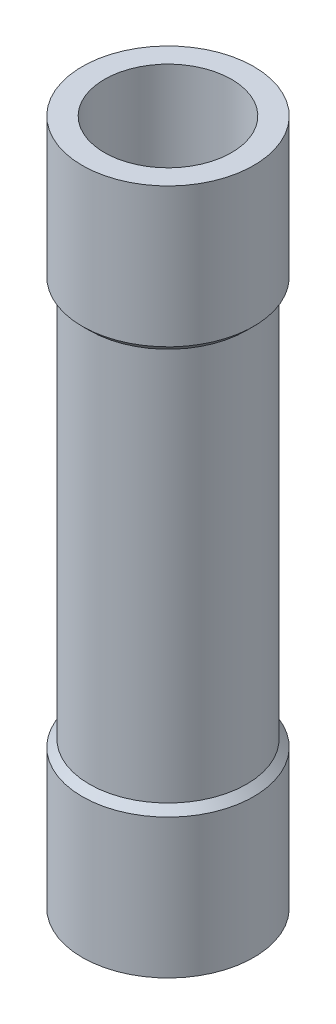
ISO-10303-21;
HEADER;
FILE_DESCRIPTION(('STEP AP214'),'2;1');
FILE_NAME('part.step','',(''),(''),'','','');
FILE_SCHEMA(('AUTOMOTIVE_DESIGN { 1 0 10303 214 1 1 1 1 }'));
ENDSEC;
DATA;
#1=APPLICATION_CONTEXT('core data for automotive mechanical design processes');
#2=APPLICATION_PROTOCOL_DEFINITION('international standard','automotive_design',2000,#1);
#3=PRODUCT_CONTEXT('',#1,'mechanical');
#4=PRODUCT('Part','Part','',(#3));
#5=PRODUCT_RELATED_PRODUCT_CATEGORY('part','',(#4));
#6=PRODUCT_DEFINITION_FORMATION('','',#4);
#7=PRODUCT_DEFINITION_CONTEXT('part definition',#1,'design');
#8=PRODUCT_DEFINITION('design','',#6,#7);
#9=PRODUCT_DEFINITION_SHAPE('','',#8);
#10=(LENGTH_UNIT() NAMED_UNIT(*) SI_UNIT(.MILLI.,.METRE.));
#11=(NAMED_UNIT(*) PLANE_ANGLE_UNIT() SI_UNIT($,.RADIAN.));
#12=(NAMED_UNIT(*) SI_UNIT($,.STERADIAN.) SOLID_ANGLE_UNIT());
#13=UNCERTAINTY_MEASURE_WITH_UNIT(LENGTH_MEASURE(1.E-05),#10,'distance_accuracy_value','');
#14=(GEOMETRIC_REPRESENTATION_CONTEXT(3) GLOBAL_UNCERTAINTY_ASSIGNED_CONTEXT((#13)) GLOBAL_UNIT_ASSIGNED_CONTEXT((#10,
#11,#12)) REPRESENTATION_CONTEXT('',''));
#15=CARTESIAN_POINT('',(0.,0.,0.));
#16=DIRECTION('',(0.,0.,1.));
#17=DIRECTION('',(1.,0.,0.));
#18=AXIS2_PLACEMENT_3D('',#15,#16,#17);
#19=CARTESIAN_POINT('',(3.048,12.192,0.));
#20=DIRECTION('',(0.,1.,0.));
#21=DIRECTION('',(0.,0.,1.));
#22=AXIS2_PLACEMENT_3D('',#19,#20,#21);
#23=PLANE('',#22);
#24=CARTESIAN_POINT('',(0.,12.192,0.));
#25=DIRECTION('',(0.,-1.,0.));
#26=DIRECTION('',(0.,0.,-1.));
#27=AXIS2_PLACEMENT_3D('',#24,#25,#26);
#28=CIRCLE('',#27,2.259);
#29=CARTESIAN_POINT('',(0.,12.192,-2.259));
#30=VERTEX_POINT('',#29);
#31=EDGE_CURVE('E11',#30,#30,#28,.T.);
#32=ORIENTED_EDGE('',*,*,#31,.T.);
#33=EDGE_LOOP('',(#32));
#34=FACE_BOUND('',#33,.T.);
#35=CARTESIAN_POINT('',(0.,12.192,0.));
#36=DIRECTION('',(0.,-1.,0.));
#37=DIRECTION('',(0.,0.,-1.));
#38=AXIS2_PLACEMENT_3D('',#35,#36,#37);
#39=CIRCLE('',#38,3.048);
#40=CARTESIAN_POINT('',(0.,12.192,-3.048));
#41=VERTEX_POINT('',#40);
#42=EDGE_CURVE('E71',#41,#41,#39,.T.);
#43=ORIENTED_EDGE('',*,*,#42,.F.);
#44=EDGE_LOOP('',(#43));
#45=FACE_BOUND('',#44,.T.);
#46=ADVANCED_FACE('F43',(#34,#45),#23,.T.);
#47=CARTESIAN_POINT('',(0.,0.,0.));
#48=DIRECTION('',(0.,-1.,0.));
#49=DIRECTION('',(0.,0.,-1.));
#50=AXIS2_PLACEMENT_3D('',#47,#48,#49);
#51=CYLINDRICAL_SURFACE('',#50,2.259);
#52=CARTESIAN_POINT('',(0.,-12.192,0.));
#53=DIRECTION('',(0.,-1.,0.));
#54=DIRECTION('',(0.,0.,-1.));
#55=AXIS2_PLACEMENT_3D('',#52,#53,#54);
#56=CIRCLE('',#55,2.259);
#57=CARTESIAN_POINT('',(0.,-12.192,-2.259));
#58=VERTEX_POINT('',#57);
#59=EDGE_CURVE('E49',#58,#58,#56,.T.);
#60=ORIENTED_EDGE('',*,*,#59,.T.);
#61=EDGE_LOOP('',(#60));
#62=FACE_BOUND('',#61,.T.);
#63=ORIENTED_EDGE('',*,*,#31,.F.);
#64=EDGE_LOOP('',(#63));
#65=FACE_BOUND('',#64,.T.);
#66=ADVANCED_FACE('F79',(#62,#65),#51,.F.);
#67=CARTESIAN_POINT('',(2.259,-12.192,0.));
#68=DIRECTION('',(0.,-1.,0.));
#69=DIRECTION('',(0.,0.,-1.));
#70=AXIS2_PLACEMENT_3D('',#67,#68,#69);
#71=PLANE('',#70);
#72=CARTESIAN_POINT('',(0.,-12.192,0.));
#73=DIRECTION('',(0.,-1.,0.));
#74=DIRECTION('',(0.,0.,-1.));
#75=AXIS2_PLACEMENT_3D('',#72,#73,#74);
#76=CIRCLE('',#75,3.048);
#77=CARTESIAN_POINT('',(0.,-12.192,-3.048));
#78=VERTEX_POINT('',#77);
#79=EDGE_CURVE('E53',#78,#78,#76,.T.);
#80=ORIENTED_EDGE('',*,*,#79,.T.);
#81=EDGE_LOOP('',(#80));
#82=FACE_BOUND('',#81,.T.);
#83=ORIENTED_EDGE('',*,*,#59,.F.);
#84=EDGE_LOOP('',(#83));
#85=FACE_BOUND('',#84,.T.);
#86=ADVANCED_FACE('F83',(#82,#85),#71,.T.);
#87=CARTESIAN_POINT('',(0.,0.,0.));
#88=DIRECTION('',(0.,-1.,0.));
#89=DIRECTION('',(0.,0.,-1.));
#90=AXIS2_PLACEMENT_3D('',#87,#88,#89);
#91=CYLINDRICAL_SURFACE('',#90,3.048);
#92=CARTESIAN_POINT('',(0.,-7.239,0.));
#93=DIRECTION('',(0.,-1.,0.));
#94=DIRECTION('',(0.,0.,-1.));
#95=AXIS2_PLACEMENT_3D('',#92,#93,#94);
#96=CIRCLE('',#95,3.048);
#97=CARTESIAN_POINT('',(0.,-7.239,-3.048));
#98=VERTEX_POINT('',#97);
#99=EDGE_CURVE('E57',#98,#98,#96,.T.);
#100=ORIENTED_EDGE('',*,*,#99,.T.);
#101=EDGE_LOOP('',(#100));
#102=FACE_BOUND('',#101,.T.);
#103=ORIENTED_EDGE('',*,*,#79,.F.);
#104=EDGE_LOOP('',(#103));
#105=FACE_BOUND('',#104,.T.);
#106=ADVANCED_FACE('F87',(#102,#105),#91,.T.);
#107=CARTESIAN_POINT('',(0.,-7.239,0.));
#108=DIRECTION('',(0.,-1.,0.));
#109=DIRECTION('',(0.,0.,-1.));
#110=AXIS2_PLACEMENT_3D('',#107,#108,#109);
#111=CONICAL_SURFACE('',#110,3.048,0.785398163397442);
#112=CARTESIAN_POINT('',(0.,-6.98499999999999,0.));
#113=DIRECTION('',(0.,-1.,0.));
#114=DIRECTION('',(0.,0.,-1.));
#115=AXIS2_PLACEMENT_3D('',#112,#113,#114);
#116=CIRCLE('',#115,2.794);
#117=CARTESIAN_POINT('',(0.,-6.98499999999999,-2.794));
#118=VERTEX_POINT('',#117);
#119=EDGE_CURVE('E62',#118,#118,#116,.T.);
#120=ORIENTED_EDGE('',*,*,#119,.T.);
#121=EDGE_LOOP('',(#120));
#122=FACE_BOUND('',#121,.T.);
#123=ORIENTED_EDGE('',*,*,#99,.F.);
#124=EDGE_LOOP('',(#123));
#125=FACE_BOUND('',#124,.T.);
#126=ADVANCED_FACE('F94',(#122,#125),#111,.T.);
#127=CARTESIAN_POINT('',(0.,0.,0.));
#128=DIRECTION('',(0.,-1.,0.));
#129=DIRECTION('',(0.,0.,-1.));
#130=AXIS2_PLACEMENT_3D('',#127,#128,#129);
#131=CYLINDRICAL_SURFACE('',#130,2.794);
#132=CARTESIAN_POINT('',(0.,6.98499999999999,0.));
#133=DIRECTION('',(0.,-1.,0.));
#134=DIRECTION('',(0.,0.,-1.));
#135=AXIS2_PLACEMENT_3D('',#132,#133,#134);
#136=CIRCLE('',#135,2.794);
#137=CARTESIAN_POINT('',(0.,6.98499999999999,-2.794));
#138=VERTEX_POINT('',#137);
#139=EDGE_CURVE('E65',#138,#138,#136,.T.);
#140=ORIENTED_EDGE('',*,*,#139,.T.);
#141=EDGE_LOOP('',(#140));
#142=FACE_BOUND('',#141,.T.);
#143=ORIENTED_EDGE('',*,*,#119,.F.);
#144=EDGE_LOOP('',(#143));
#145=FACE_BOUND('',#144,.T.);
#146=ADVANCED_FACE('F98',(#142,#145),#131,.T.);
#147=CARTESIAN_POINT('',(0.,6.98499999999999,0.));
#148=DIRECTION('',(0.,1.,0.));
#149=DIRECTION('',(0.,0.,1.));
#150=AXIS2_PLACEMENT_3D('',#147,#148,#149);
#151=CONICAL_SURFACE('',#150,2.794,0.785398163397442);
#152=CARTESIAN_POINT('',(0.,7.239,0.));
#153=DIRECTION('',(0.,-1.,0.));
#154=DIRECTION('',(0.,0.,-1.));
#155=AXIS2_PLACEMENT_3D('',#152,#153,#154);
#156=CIRCLE('',#155,3.048);
#157=CARTESIAN_POINT('',(0.,7.239,-3.048));
#158=VERTEX_POINT('',#157);
#159=EDGE_CURVE('E68',#158,#158,#156,.T.);
#160=ORIENTED_EDGE('',*,*,#159,.T.);
#161=EDGE_LOOP('',(#160));
#162=FACE_BOUND('',#161,.T.);
#163=ORIENTED_EDGE('',*,*,#139,.F.);
#164=EDGE_LOOP('',(#163));
#165=FACE_BOUND('',#164,.T.);
#166=ADVANCED_FACE('F102',(#162,#165),#151,.T.);
#167=CARTESIAN_POINT('',(0.,0.,0.));
#168=DIRECTION('',(0.,-1.,0.));
#169=DIRECTION('',(0.,0.,-1.));
#170=AXIS2_PLACEMENT_3D('',#167,#168,#169);
#171=CYLINDRICAL_SURFACE('',#170,3.048);
#172=ORIENTED_EDGE('',*,*,#42,.T.);
#173=EDGE_LOOP('',(#172));
#174=FACE_BOUND('',#173,.T.);
#175=ORIENTED_EDGE('',*,*,#159,.F.);
#176=EDGE_LOOP('',(#175));
#177=FACE_BOUND('',#176,.T.);
#178=ADVANCED_FACE('F75',(#174,#177),#171,.T.);
#179=CLOSED_SHELL('',(#46,#66,#86,#106,#126,#146,#166,#178));
#180=MANIFOLD_SOLID_BREP('B2',#179);
#181=CARTESIAN_POINT('',(0.,0.,0.));
#182=DIRECTION('',(0.,-1.,0.));
#183=DIRECTION('',(0.,0.,-1.));
#184=AXIS2_PLACEMENT_3D('',#181,#182,#183);
#185=CYLINDRICAL_SURFACE('',#184,2.159);
#186=CARTESIAN_POINT('',(0.,7.239,0.));
#187=DIRECTION('',(0.,-1.,0.));
#188=DIRECTION('',(0.,0.,-1.));
#189=AXIS2_PLACEMENT_3D('',#186,#187,#188);
#190=CIRCLE('',#189,2.159);
#191=CARTESIAN_POINT('',(0.,7.239,-2.159));
#192=VERTEX_POINT('',#191);
#193=EDGE_CURVE('E179',#192,#192,#190,.T.);
#194=ORIENTED_EDGE('',*,*,#193,.T.);
#195=EDGE_LOOP('',(#194));
#196=FACE_BOUND('',#195,.T.);
#197=CARTESIAN_POINT('',(0.,-7.239,0.));
#198=DIRECTION('',(0.,-1.,0.));
#199=DIRECTION('',(0.,0.,-1.));
#200=AXIS2_PLACEMENT_3D('',#197,#198,#199);
#201=CIRCLE('',#200,2.159);
#202=CARTESIAN_POINT('',(0.,-7.239,-2.159));
#203=VERTEX_POINT('',#202);
#204=EDGE_CURVE('E42',#203,#203,#201,.T.);
#205=ORIENTED_EDGE('',*,*,#204,.F.);
#206=EDGE_LOOP('',(#205));
#207=FACE_BOUND('',#206,.T.);
#208=ADVANCED_FACE('F165',(#196,#207),#185,.T.);
#209=CARTESIAN_POINT('',(1.016,-7.239,0.));
#210=DIRECTION('',(0.,-1.,0.));
#211=DIRECTION('',(0.,0.,-1.));
#212=AXIS2_PLACEMENT_3D('',#209,#210,#211);
#213=PLANE('',#212);
#214=ORIENTED_EDGE('',*,*,#204,.T.);
#215=EDGE_LOOP('',(#214));
#216=FACE_BOUND('',#215,.T.);
#217=CARTESIAN_POINT('',(0.,-7.239,0.));
#218=DIRECTION('',(0.,-1.,0.));
#219=DIRECTION('',(0.,0.,-1.));
#220=AXIS2_PLACEMENT_3D('',#217,#218,#219);
#221=CIRCLE('',#220,1.016);
#222=CARTESIAN_POINT('',(0.,-7.239,-1.016));
#223=VERTEX_POINT('',#222);
#224=EDGE_CURVE('E171',#223,#223,#221,.T.);
#225=ORIENTED_EDGE('',*,*,#224,.F.);
#226=EDGE_LOOP('',(#225));
#227=FACE_BOUND('',#226,.T.);
#228=ADVANCED_FACE('F195',(#216,#227),#213,.T.);
#229=CARTESIAN_POINT('',(0.,0.,0.));
#230=DIRECTION('',(0.,-1.,0.));
#231=DIRECTION('',(0.,0.,-1.));
#232=AXIS2_PLACEMENT_3D('',#229,#230,#231);
#233=CYLINDRICAL_SURFACE('',#232,1.016);
#234=ORIENTED_EDGE('',*,*,#224,.T.);
#235=EDGE_LOOP('',(#234));
#236=FACE_BOUND('',#235,.T.);
#237=CARTESIAN_POINT('',(0.,7.239,0.));
#238=DIRECTION('',(0.,-1.,0.));
#239=DIRECTION('',(0.,0.,-1.));
#240=AXIS2_PLACEMENT_3D('',#237,#238,#239);
#241=CIRCLE('',#240,1.016);
#242=CARTESIAN_POINT('',(0.,7.239,-1.016));
#243=VERTEX_POINT('',#242);
#244=EDGE_CURVE('E175',#243,#243,#241,.T.);
#245=ORIENTED_EDGE('',*,*,#244,.F.);
#246=EDGE_LOOP('',(#245));
#247=FACE_BOUND('',#246,.T.);
#248=ADVANCED_FACE('F189',(#236,#247),#233,.F.);
#249=CARTESIAN_POINT('',(1.016,7.239,0.));
#250=DIRECTION('',(0.,1.,0.));
#251=DIRECTION('',(0.,0.,1.));
#252=AXIS2_PLACEMENT_3D('',#249,#250,#251);
#253=PLANE('',#252);
#254=ORIENTED_EDGE('',*,*,#244,.T.);
#255=EDGE_LOOP('',(#254));
#256=FACE_BOUND('',#255,.T.);
#257=ORIENTED_EDGE('',*,*,#193,.F.);
#258=EDGE_LOOP('',(#257));
#259=FACE_BOUND('',#258,.T.);
#260=ADVANCED_FACE('F187',(#256,#259),#253,.T.);
#261=CLOSED_SHELL('',(#208,#228,#248,#260));
#262=MANIFOLD_SOLID_BREP('B6',#261);
#263=ADVANCED_BREP_SHAPE_REPRESENTATION('',(#18,#180,#262),#14);
#264=SHAPE_DEFINITION_REPRESENTATION(#9,#263);
ENDSEC;
END-ISO-10303-21;
